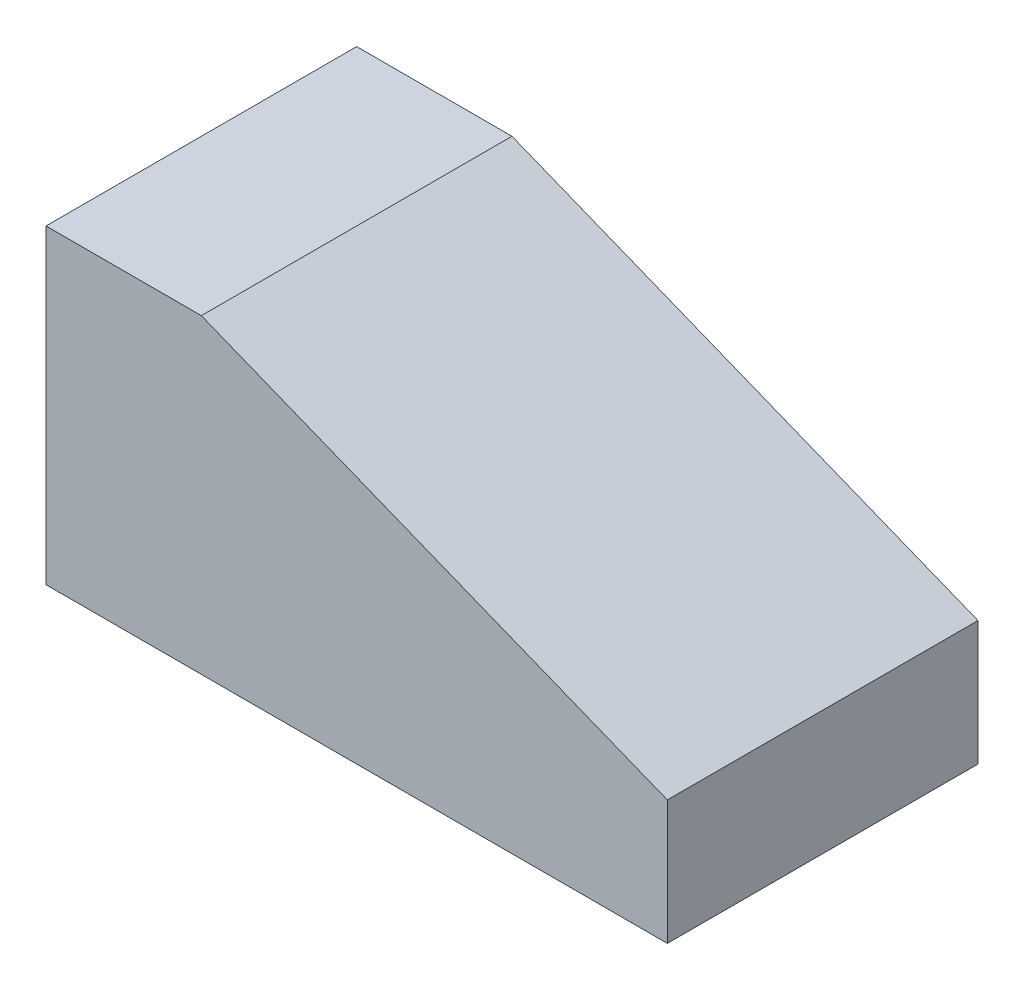
ISO-10303-21;
HEADER;
FILE_DESCRIPTION(('STEP AP214'),'2;1');
FILE_NAME('part.step','',(''),(''),'','','');
FILE_SCHEMA(('AUTOMOTIVE_DESIGN { 1 0 10303 214 1 1 1 1 }'));
ENDSEC;
DATA;
#1=APPLICATION_CONTEXT('core data for automotive mechanical design processes');
#2=APPLICATION_PROTOCOL_DEFINITION('international standard','automotive_design',2000,#1);
#3=PRODUCT_CONTEXT('',#1,'mechanical');
#4=PRODUCT('Part','Part','',(#3));
#5=PRODUCT_RELATED_PRODUCT_CATEGORY('part','',(#4));
#6=PRODUCT_DEFINITION_FORMATION('','',#4);
#7=PRODUCT_DEFINITION_CONTEXT('part definition',#1,'design');
#8=PRODUCT_DEFINITION('design','',#6,#7);
#9=PRODUCT_DEFINITION_SHAPE('','',#8);
#10=(LENGTH_UNIT() NAMED_UNIT(*) SI_UNIT(.MILLI.,.METRE.));
#11=(NAMED_UNIT(*) PLANE_ANGLE_UNIT() SI_UNIT($,.RADIAN.));
#12=(NAMED_UNIT(*) SI_UNIT($,.STERADIAN.) SOLID_ANGLE_UNIT());
#13=UNCERTAINTY_MEASURE_WITH_UNIT(LENGTH_MEASURE(1.E-05),#10,'distance_accuracy_value','');
#14=(GEOMETRIC_REPRESENTATION_CONTEXT(3) GLOBAL_UNCERTAINTY_ASSIGNED_CONTEXT((#13)) GLOBAL_UNIT_ASSIGNED_CONTEXT((#10,
#11,#12)) REPRESENTATION_CONTEXT('',''));
#15=CARTESIAN_POINT('',(0.,0.,0.));
#16=DIRECTION('',(0.,0.,1.));
#17=DIRECTION('',(1.,0.,0.));
#18=AXIS2_PLACEMENT_3D('',#15,#16,#17);
#19=CARTESIAN_POINT('',(100.,0.,50.));
#20=DIRECTION('',(0.,1.,0.));
#21=DIRECTION('',(-1.,0.,0.));
#22=AXIS2_PLACEMENT_3D('',#19,#20,#21);
#23=PLANE('',#22);
#24=DIRECTION('',(1.,0.,0.));
#25=VECTOR('',#24,1.);
#26=CARTESIAN_POINT('',(100.,0.,0.));
#27=LINE('',#26,#25);
#28=CARTESIAN_POINT('',(0.,0.,0.));
#29=VERTEX_POINT('',#28);
#30=CARTESIAN_POINT('',(100.,0.,0.));
#31=VERTEX_POINT('',#30);
#32=EDGE_CURVE('E107',#29,#31,#27,.T.);
#33=ORIENTED_EDGE('',*,*,#32,.T.);
#34=DIRECTION('',(0.,0.,-1.));
#35=VECTOR('',#34,1.);
#36=CARTESIAN_POINT('',(100.,0.,50.));
#37=LINE('',#36,#35);
#38=CARTESIAN_POINT('',(100.,0.,50.));
#39=VERTEX_POINT('',#38);
#40=EDGE_CURVE('E11',#39,#31,#37,.T.);
#41=ORIENTED_EDGE('',*,*,#40,.F.);
#42=DIRECTION('',(1.,0.,0.));
#43=VECTOR('',#42,1.);
#44=CARTESIAN_POINT('',(100.,0.,50.));
#45=LINE('',#44,#43);
#46=CARTESIAN_POINT('',(0.,0.,50.));
#47=VERTEX_POINT('',#46);
#48=EDGE_CURVE('E115',#47,#39,#45,.T.);
#49=ORIENTED_EDGE('',*,*,#48,.F.);
#50=DIRECTION('',(0.,0.,-1.));
#51=VECTOR('',#50,1.);
#52=CARTESIAN_POINT('',(0.,0.,50.));
#53=LINE('',#52,#51);
#54=EDGE_CURVE('E103',#47,#29,#53,.T.);
#55=ORIENTED_EDGE('',*,*,#54,.T.);
#56=EDGE_LOOP('',(#33,#41,#49,#55));
#57=FACE_BOUND('',#56,.T.);
#58=ADVANCED_FACE('F33',(#57),#23,.F.);
#59=CARTESIAN_POINT('',(100.,20.,50.));
#60=DIRECTION('',(-1.,0.,0.));
#61=DIRECTION('',(0.,-1.,0.));
#62=AXIS2_PLACEMENT_3D('',#59,#60,#61);
#63=PLANE('',#62);
#64=DIRECTION('',(0.,1.,0.));
#65=VECTOR('',#64,1.);
#66=CARTESIAN_POINT('',(100.,20.,0.));
#67=LINE('',#66,#65);
#68=CARTESIAN_POINT('',(100.,20.,0.));
#69=VERTEX_POINT('',#68);
#70=EDGE_CURVE('E110',#31,#69,#67,.T.);
#71=ORIENTED_EDGE('',*,*,#70,.T.);
#72=DIRECTION('',(0.,0.,-1.));
#73=VECTOR('',#72,1.);
#74=CARTESIAN_POINT('',(100.,20.,50.));
#75=LINE('',#74,#73);
#76=CARTESIAN_POINT('',(100.,20.,50.));
#77=VERTEX_POINT('',#76);
#78=EDGE_CURVE('E41',#77,#69,#75,.T.);
#79=ORIENTED_EDGE('',*,*,#78,.F.);
#80=DIRECTION('',(0.,1.,0.));
#81=VECTOR('',#80,1.);
#82=CARTESIAN_POINT('',(100.,20.,50.));
#83=LINE('',#82,#81);
#84=EDGE_CURVE('E83',#39,#77,#83,.T.);
#85=ORIENTED_EDGE('',*,*,#84,.F.);
#86=ORIENTED_EDGE('',*,*,#40,.T.);
#87=EDGE_LOOP('',(#71,#79,#85,#86));
#88=FACE_BOUND('',#87,.T.);
#89=ADVANCED_FACE('F134',(#88),#63,.F.);
#90=CARTESIAN_POINT('',(25.,50.,50.));
#91=DIRECTION('',(-0.371390676354104,-0.928476690885259,0.));
#92=DIRECTION('',(0.928476690885259,-0.371390676354104,0.));
#93=AXIS2_PLACEMENT_3D('',#90,#91,#92);
#94=PLANE('',#93);
#95=DIRECTION('',(-0.928476690885259,0.371390676354104,0.));
#96=VECTOR('',#95,1.);
#97=CARTESIAN_POINT('',(25.,50.,0.));
#98=LINE('',#97,#96);
#99=CARTESIAN_POINT('',(25.,50.,0.));
#100=VERTEX_POINT('',#99);
#101=EDGE_CURVE('E98',#69,#100,#98,.T.);
#102=ORIENTED_EDGE('',*,*,#101,.T.);
#103=DIRECTION('',(0.,0.,-1.));
#104=VECTOR('',#103,1.);
#105=CARTESIAN_POINT('',(25.,50.,50.));
#106=LINE('',#105,#104);
#107=CARTESIAN_POINT('',(25.,50.,50.));
#108=VERTEX_POINT('',#107);
#109=EDGE_CURVE('E95',#108,#100,#106,.T.);
#110=ORIENTED_EDGE('',*,*,#109,.F.);
#111=DIRECTION('',(-0.928476690885259,0.371390676354104,0.));
#112=VECTOR('',#111,1.);
#113=CARTESIAN_POINT('',(25.,50.,50.));
#114=LINE('',#113,#112);
#115=EDGE_CURVE('E87',#77,#108,#114,.T.);
#116=ORIENTED_EDGE('',*,*,#115,.F.);
#117=ORIENTED_EDGE('',*,*,#78,.T.);
#118=EDGE_LOOP('',(#102,#110,#116,#117));
#119=FACE_BOUND('',#118,.T.);
#120=ADVANCED_FACE('F96',(#119),#94,.F.);
#121=CARTESIAN_POINT('',(0.,50.,50.));
#122=DIRECTION('',(0.,-1.,0.));
#123=DIRECTION('',(0.,0.,-1.));
#124=AXIS2_PLACEMENT_3D('',#121,#122,#123);
#125=PLANE('',#124);
#126=DIRECTION('',(-1.,0.,0.));
#127=VECTOR('',#126,1.);
#128=CARTESIAN_POINT('',(0.,50.,0.));
#129=LINE('',#128,#127);
#130=CARTESIAN_POINT('',(0.,50.,0.));
#131=VERTEX_POINT('',#130);
#132=EDGE_CURVE('E69',#100,#131,#129,.T.);
#133=ORIENTED_EDGE('',*,*,#132,.T.);
#134=DIRECTION('',(0.,0.,-1.));
#135=VECTOR('',#134,1.);
#136=CARTESIAN_POINT('',(0.,50.,50.));
#137=LINE('',#136,#135);
#138=CARTESIAN_POINT('',(0.,50.,50.));
#139=VERTEX_POINT('',#138);
#140=EDGE_CURVE('E99',#139,#131,#137,.T.);
#141=ORIENTED_EDGE('',*,*,#140,.F.);
#142=DIRECTION('',(-1.,0.,0.));
#143=VECTOR('',#142,1.);
#144=CARTESIAN_POINT('',(0.,50.,50.));
#145=LINE('',#144,#143);
#146=EDGE_CURVE('E91',#108,#139,#145,.T.);
#147=ORIENTED_EDGE('',*,*,#146,.F.);
#148=ORIENTED_EDGE('',*,*,#109,.T.);
#149=EDGE_LOOP('',(#133,#141,#147,#148));
#150=FACE_BOUND('',#149,.T.);
#151=ADVANCED_FACE('F101',(#150),#125,.F.);
#152=CARTESIAN_POINT('',(0.,0.,50.));
#153=DIRECTION('',(1.,0.,0.));
#154=DIRECTION('',(0.,0.,-1.));
#155=AXIS2_PLACEMENT_3D('',#152,#153,#154);
#156=PLANE('',#155);
#157=DIRECTION('',(0.,-1.,0.));
#158=VECTOR('',#157,1.);
#159=CARTESIAN_POINT('',(0.,0.,0.));
#160=LINE('',#159,#158);
#161=EDGE_CURVE('E75',#131,#29,#160,.T.);
#162=ORIENTED_EDGE('',*,*,#161,.T.);
#163=ORIENTED_EDGE('',*,*,#54,.F.);
#164=DIRECTION('',(0.,-1.,0.));
#165=VECTOR('',#164,1.);
#166=CARTESIAN_POINT('',(0.,0.,50.));
#167=LINE('',#166,#165);
#168=EDGE_CURVE('E49',#139,#47,#167,.T.);
#169=ORIENTED_EDGE('',*,*,#168,.F.);
#170=ORIENTED_EDGE('',*,*,#140,.T.);
#171=EDGE_LOOP('',(#162,#163,#169,#170));
#172=FACE_BOUND('',#171,.T.);
#173=ADVANCED_FACE('F123',(#172),#156,.F.);
#174=CARTESIAN_POINT('',(0.,0.,50.));
#175=DIRECTION('',(0.,0.,-1.));
#176=DIRECTION('',(-1.,0.,0.));
#177=AXIS2_PLACEMENT_3D('',#174,#175,#176);
#178=PLANE('',#177);
#179=ORIENTED_EDGE('',*,*,#48,.T.);
#180=ORIENTED_EDGE('',*,*,#84,.T.);
#181=ORIENTED_EDGE('',*,*,#115,.T.);
#182=ORIENTED_EDGE('',*,*,#146,.T.);
#183=ORIENTED_EDGE('',*,*,#168,.T.);
#184=EDGE_LOOP('',(#179,#180,#181,#182,#183));
#185=FACE_BOUND('',#184,.T.);
#186=ADVANCED_FACE('F89',(#185),#178,.F.);
#187=CARTESIAN_POINT('',(0.,0.,0.));
#188=DIRECTION('',(0.,0.,-1.));
#189=DIRECTION('',(-1.,0.,0.));
#190=AXIS2_PLACEMENT_3D('',#187,#188,#189);
#191=PLANE('',#190);
#192=ORIENTED_EDGE('',*,*,#32,.F.);
#193=ORIENTED_EDGE('',*,*,#161,.F.);
#194=ORIENTED_EDGE('',*,*,#132,.F.);
#195=ORIENTED_EDGE('',*,*,#101,.F.);
#196=ORIENTED_EDGE('',*,*,#70,.F.);
#197=EDGE_LOOP('',(#192,#193,#194,#195,#196));
#198=FACE_BOUND('',#197,.T.);
#199=ADVANCED_FACE('F119',(#198),#191,.T.);
#200=CLOSED_SHELL('',(#58,#89,#120,#151,#173,#186,#199));
#201=MANIFOLD_SOLID_BREP('B2',#200);
#202=ADVANCED_BREP_SHAPE_REPRESENTATION('',(#18,#201),#14);
#203=SHAPE_DEFINITION_REPRESENTATION(#9,#202);
ENDSEC;
END-ISO-10303-21;
